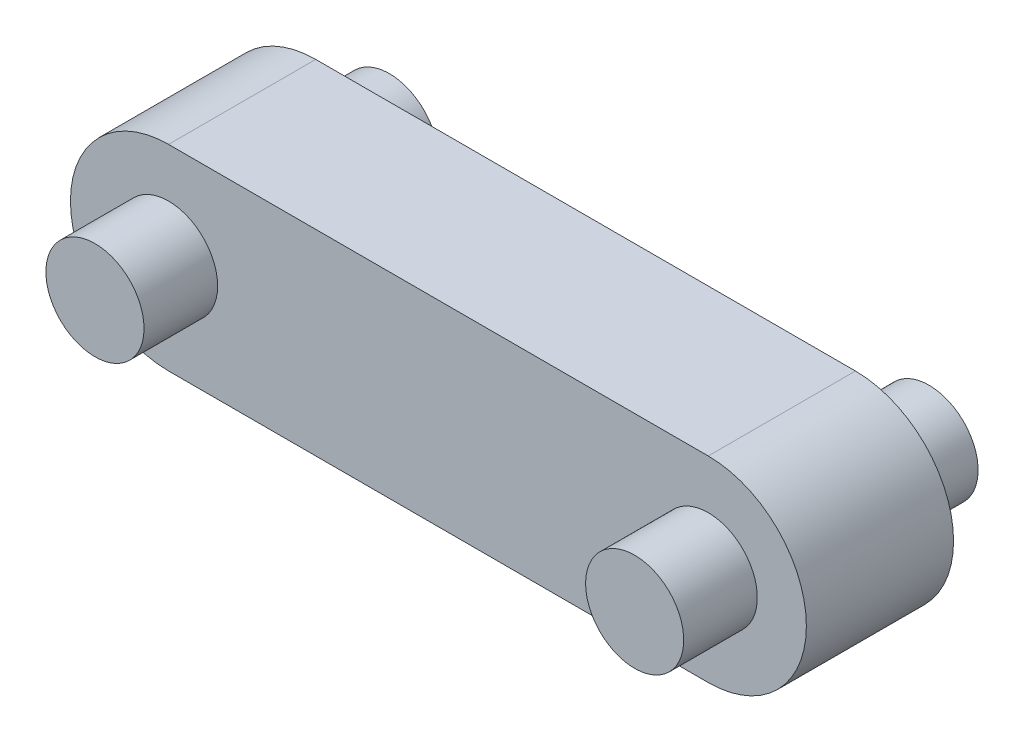
ISO-10303-21;
HEADER;
FILE_DESCRIPTION(('STEP AP214'),'2;1');
FILE_NAME('part.step','',(''),(''),'','','');
FILE_SCHEMA(('AUTOMOTIVE_DESIGN { 1 0 10303 214 1 1 1 1 }'));
ENDSEC;
DATA;
#1=APPLICATION_CONTEXT('core data for automotive mechanical design processes');
#2=APPLICATION_PROTOCOL_DEFINITION('international standard','automotive_design',2000,#1);
#3=PRODUCT_CONTEXT('',#1,'mechanical');
#4=PRODUCT('Part','Part','',(#3));
#5=PRODUCT_RELATED_PRODUCT_CATEGORY('part','',(#4));
#6=PRODUCT_DEFINITION_FORMATION('','',#4);
#7=PRODUCT_DEFINITION_CONTEXT('part definition',#1,'design');
#8=PRODUCT_DEFINITION('design','',#6,#7);
#9=PRODUCT_DEFINITION_SHAPE('','',#8);
#10=(LENGTH_UNIT() NAMED_UNIT(*) SI_UNIT(.MILLI.,.METRE.));
#11=(NAMED_UNIT(*) PLANE_ANGLE_UNIT() SI_UNIT($,.RADIAN.));
#12=(NAMED_UNIT(*) SI_UNIT($,.STERADIAN.) SOLID_ANGLE_UNIT());
#13=UNCERTAINTY_MEASURE_WITH_UNIT(LENGTH_MEASURE(1.E-05),#10,'distance_accuracy_value','');
#14=(GEOMETRIC_REPRESENTATION_CONTEXT(3) GLOBAL_UNCERTAINTY_ASSIGNED_CONTEXT((#13)) GLOBAL_UNIT_ASSIGNED_CONTEXT((#10,
#11,#12)) REPRESENTATION_CONTEXT('',''));
#15=CARTESIAN_POINT('',(0.,0.,0.));
#16=DIRECTION('',(0.,0.,1.));
#17=DIRECTION('',(1.,0.,0.));
#18=AXIS2_PLACEMENT_3D('',#15,#16,#17);
#19=CARTESIAN_POINT('',(0.,0.,30.));
#20=DIRECTION('',(0.,0.,-1.));
#21=DIRECTION('',(-1.,0.,0.));
#22=AXIS2_PLACEMENT_3D('',#19,#20,#21);
#23=CYLINDRICAL_SURFACE('',#22,10.);
#24=CARTESIAN_POINT('',(0.,0.,15.));
#25=DIRECTION('',(0.,0.,1.));
#26=DIRECTION('',(1.,0.,0.));
#27=AXIS2_PLACEMENT_3D('',#24,#25,#26);
#28=CIRCLE('',#27,10.);
#29=CARTESIAN_POINT('',(10.,0.,15.));
#30=VERTEX_POINT('',#29);
#31=EDGE_CURVE('E35',#30,#30,#28,.T.);
#32=ORIENTED_EDGE('',*,*,#31,.T.);
#33=EDGE_LOOP('',(#32));
#34=FACE_BOUND('',#33,.T.);
#35=CARTESIAN_POINT('',(0.,0.,30.));
#36=DIRECTION('',(0.,0.,1.));
#37=DIRECTION('',(1.,0.,0.));
#38=AXIS2_PLACEMENT_3D('',#35,#36,#37);
#39=CIRCLE('',#38,10.);
#40=CARTESIAN_POINT('',(10.,0.,30.));
#41=VERTEX_POINT('',#40);
#42=EDGE_CURVE('E41',#41,#41,#39,.T.);
#43=ORIENTED_EDGE('',*,*,#42,.F.);
#44=EDGE_LOOP('',(#43));
#45=FACE_BOUND('',#44,.T.);
#46=ADVANCED_FACE('F32',(#34,#45),#23,.T.);
#47=CARTESIAN_POINT('',(0.,0.,30.));
#48=DIRECTION('',(0.,0.,1.));
#49=DIRECTION('',(1.,0.,0.));
#50=AXIS2_PLACEMENT_3D('',#47,#48,#49);
#51=PLANE('',#50);
#52=ORIENTED_EDGE('',*,*,#42,.T.);
#53=EDGE_LOOP('',(#52));
#54=FACE_BOUND('',#53,.T.);
#55=ADVANCED_FACE('F135',(#54),#51,.T.);
#56=CARTESIAN_POINT('',(0.,0.,15.));
#57=DIRECTION('',(0.,0.,1.));
#58=DIRECTION('',(1.,0.,0.));
#59=AXIS2_PLACEMENT_3D('',#56,#57,#58);
#60=PLANE('',#59);
#61=CARTESIAN_POINT('',(0.,0.,15.));
#62=DIRECTION('',(0.,0.,1.));
#63=DIRECTION('',(1.,0.,0.));
#64=AXIS2_PLACEMENT_3D('',#61,#62,#63);
#65=CIRCLE('',#64,20.);
#66=CARTESIAN_POINT('',(0.,20.,15.));
#67=VERTEX_POINT('',#66);
#68=CARTESIAN_POINT('',(0.,-20.,15.));
#69=VERTEX_POINT('',#68);
#70=EDGE_CURVE('E83',#67,#69,#65,.T.);
#71=ORIENTED_EDGE('',*,*,#70,.T.);
#72=DIRECTION('',(1.,0.,0.));
#73=VECTOR('',#72,1.);
#74=CARTESIAN_POINT('',(55.,-20.,15.));
#75=LINE('',#74,#73);
#76=CARTESIAN_POINT('',(110.,-20.,15.));
#77=VERTEX_POINT('',#76);
#78=EDGE_CURVE('E112',#69,#77,#75,.T.);
#79=ORIENTED_EDGE('',*,*,#78,.T.);
#80=CARTESIAN_POINT('',(110.,0.,15.));
#81=DIRECTION('',(0.,0.,-1.));
#82=DIRECTION('',(-1.,0.,0.));
#83=AXIS2_PLACEMENT_3D('',#80,#81,#82);
#84=CIRCLE('',#83,20.);
#85=CARTESIAN_POINT('',(110.,20.,15.));
#86=VERTEX_POINT('',#85);
#87=EDGE_CURVE('E90',#86,#77,#84,.T.);
#88=ORIENTED_EDGE('',*,*,#87,.F.);
#89=DIRECTION('',(-1.,0.,0.));
#90=VECTOR('',#89,1.);
#91=CARTESIAN_POINT('',(0.,20.,15.));
#92=LINE('',#91,#90);
#93=EDGE_CURVE('E49',#86,#67,#92,.T.);
#94=ORIENTED_EDGE('',*,*,#93,.T.);
#95=EDGE_LOOP('',(#71,#79,#88,#94));
#96=FACE_BOUND('',#95,.T.);
#97=ORIENTED_EDGE('',*,*,#31,.F.);
#98=EDGE_LOOP('',(#97));
#99=FACE_BOUND('',#98,.T.);
#100=CARTESIAN_POINT('',(110.,0.,15.));
#101=DIRECTION('',(0.,0.,-1.));
#102=DIRECTION('',(-1.,0.,0.));
#103=AXIS2_PLACEMENT_3D('',#100,#101,#102);
#104=CIRCLE('',#103,10.);
#105=CARTESIAN_POINT('',(100.,0.,15.));
#106=VERTEX_POINT('',#105);
#107=EDGE_CURVE('E99',#106,#106,#104,.T.);
#108=ORIENTED_EDGE('',*,*,#107,.T.);
#109=EDGE_LOOP('',(#108));
#110=FACE_BOUND('',#109,.T.);
#111=ADVANCED_FACE('F132',(#96,#99,#110),#60,.T.);
#112=CARTESIAN_POINT('',(0.,0.,-15.));
#113=DIRECTION('',(0.,0.,1.));
#114=DIRECTION('',(1.,0.,0.));
#115=AXIS2_PLACEMENT_3D('',#112,#113,#114);
#116=PLANE('',#115);
#117=CARTESIAN_POINT('',(0.,0.,-15.));
#118=DIRECTION('',(0.,0.,1.));
#119=DIRECTION('',(1.,0.,0.));
#120=AXIS2_PLACEMENT_3D('',#117,#118,#119);
#121=CIRCLE('',#120,20.);
#122=CARTESIAN_POINT('',(0.,20.,-15.));
#123=VERTEX_POINT('',#122);
#124=CARTESIAN_POINT('',(0.,-20.,-15.));
#125=VERTEX_POINT('',#124);
#126=EDGE_CURVE('E81',#123,#125,#121,.T.);
#127=ORIENTED_EDGE('',*,*,#126,.F.);
#128=DIRECTION('',(-1.,0.,0.));
#129=VECTOR('',#128,1.);
#130=CARTESIAN_POINT('',(0.,20.,-15.));
#131=LINE('',#130,#129);
#132=CARTESIAN_POINT('',(110.,20.,-15.));
#133=VERTEX_POINT('',#132);
#134=EDGE_CURVE('E75',#133,#123,#131,.T.);
#135=ORIENTED_EDGE('',*,*,#134,.F.);
#136=CARTESIAN_POINT('',(110.,0.,-15.));
#137=DIRECTION('',(0.,0.,-1.));
#138=DIRECTION('',(-1.,0.,0.));
#139=AXIS2_PLACEMENT_3D('',#136,#137,#138);
#140=CIRCLE('',#139,20.);
#141=CARTESIAN_POINT('',(110.,-20.,-15.));
#142=VERTEX_POINT('',#141);
#143=EDGE_CURVE('E79',#133,#142,#140,.T.);
#144=ORIENTED_EDGE('',*,*,#143,.T.);
#145=DIRECTION('',(1.,0.,0.));
#146=VECTOR('',#145,1.);
#147=CARTESIAN_POINT('',(55.,-20.,-15.));
#148=LINE('',#147,#146);
#149=EDGE_CURVE('E61',#125,#142,#148,.T.);
#150=ORIENTED_EDGE('',*,*,#149,.F.);
#151=EDGE_LOOP('',(#127,#135,#144,#150));
#152=FACE_BOUND('',#151,.T.);
#153=CARTESIAN_POINT('',(0.,0.,-15.));
#154=DIRECTION('',(0.,0.,1.));
#155=DIRECTION('',(1.,0.,0.));
#156=AXIS2_PLACEMENT_3D('',#153,#154,#155);
#157=CIRCLE('',#156,10.);
#158=CARTESIAN_POINT('',(10.,0.,-15.));
#159=VERTEX_POINT('',#158);
#160=EDGE_CURVE('E11',#159,#159,#157,.T.);
#161=ORIENTED_EDGE('',*,*,#160,.T.);
#162=EDGE_LOOP('',(#161));
#163=FACE_BOUND('',#162,.T.);
#164=CARTESIAN_POINT('',(110.,0.,-15.));
#165=DIRECTION('',(0.,0.,-1.));
#166=DIRECTION('',(-1.,0.,0.));
#167=AXIS2_PLACEMENT_3D('',#164,#165,#166);
#168=CIRCLE('',#167,10.);
#169=CARTESIAN_POINT('',(100.,0.,-15.));
#170=VERTEX_POINT('',#169);
#171=EDGE_CURVE('E103',#170,#170,#168,.T.);
#172=ORIENTED_EDGE('',*,*,#171,.F.);
#173=EDGE_LOOP('',(#172));
#174=FACE_BOUND('',#173,.T.);
#175=ADVANCED_FACE('F76',(#152,#163,#174),#116,.F.);
#176=CARTESIAN_POINT('',(0.,0.,15.));
#177=DIRECTION('',(0.,0.,-1.));
#178=DIRECTION('',(-1.,0.,0.));
#179=AXIS2_PLACEMENT_3D('',#176,#177,#178);
#180=CYLINDRICAL_SURFACE('',#179,20.);
#181=ORIENTED_EDGE('',*,*,#126,.T.);
#182=DIRECTION('',(0.,0.,-1.));
#183=VECTOR('',#182,1.);
#184=CARTESIAN_POINT('',(0.,-20.,15.));
#185=LINE('',#184,#183);
#186=EDGE_CURVE('E119',#69,#125,#185,.T.);
#187=ORIENTED_EDGE('',*,*,#186,.F.);
#188=ORIENTED_EDGE('',*,*,#70,.F.);
#189=DIRECTION('',(0.,0.,-1.));
#190=VECTOR('',#189,1.);
#191=CARTESIAN_POINT('',(0.,20.,15.));
#192=LINE('',#191,#190);
#193=EDGE_CURVE('E115',#67,#123,#192,.T.);
#194=ORIENTED_EDGE('',*,*,#193,.T.);
#195=EDGE_LOOP('',(#181,#187,#188,#194));
#196=FACE_BOUND('',#195,.T.);
#197=ADVANCED_FACE('F172',(#196),#180,.T.);
#198=CARTESIAN_POINT('',(55.,-20.,15.));
#199=DIRECTION('',(0.,1.,0.));
#200=DIRECTION('',(0.,0.,1.));
#201=AXIS2_PLACEMENT_3D('',#198,#199,#200);
#202=PLANE('',#201);
#203=ORIENTED_EDGE('',*,*,#149,.T.);
#204=DIRECTION('',(0.,0.,-1.));
#205=VECTOR('',#204,1.);
#206=CARTESIAN_POINT('',(110.,-20.,15.));
#207=LINE('',#206,#205);
#208=EDGE_CURVE('E89',#77,#142,#207,.T.);
#209=ORIENTED_EDGE('',*,*,#208,.F.);
#210=ORIENTED_EDGE('',*,*,#78,.F.);
#211=ORIENTED_EDGE('',*,*,#186,.T.);
#212=EDGE_LOOP('',(#203,#209,#210,#211));
#213=FACE_BOUND('',#212,.T.);
#214=ADVANCED_FACE('F186',(#213),#202,.F.);
#215=CARTESIAN_POINT('',(0.,20.,15.));
#216=DIRECTION('',(0.,-1.,0.));
#217=DIRECTION('',(0.,0.,-1.));
#218=AXIS2_PLACEMENT_3D('',#215,#216,#217);
#219=PLANE('',#218);
#220=ORIENTED_EDGE('',*,*,#134,.T.);
#221=ORIENTED_EDGE('',*,*,#193,.F.);
#222=ORIENTED_EDGE('',*,*,#93,.F.);
#223=DIRECTION('',(0.,0.,-1.));
#224=VECTOR('',#223,1.);
#225=CARTESIAN_POINT('',(110.,20.,15.));
#226=LINE('',#225,#224);
#227=EDGE_CURVE('E85',#86,#133,#226,.T.);
#228=ORIENTED_EDGE('',*,*,#227,.T.);
#229=EDGE_LOOP('',(#220,#221,#222,#228));
#230=FACE_BOUND('',#229,.T.);
#231=ADVANCED_FACE('F86',(#230),#219,.F.);
#232=CARTESIAN_POINT('',(0.,0.,-30.));
#233=DIRECTION('',(0.,0.,1.));
#234=DIRECTION('',(1.,0.,0.));
#235=AXIS2_PLACEMENT_3D('',#232,#233,#234);
#236=PLANE('',#235);
#237=CARTESIAN_POINT('',(0.,0.,-30.));
#238=DIRECTION('',(0.,0.,1.));
#239=DIRECTION('',(1.,0.,0.));
#240=AXIS2_PLACEMENT_3D('',#237,#238,#239);
#241=CIRCLE('',#240,10.);
#242=CARTESIAN_POINT('',(10.,0.,-30.));
#243=VERTEX_POINT('',#242);
#244=EDGE_CURVE('E123',#243,#243,#241,.T.);
#245=ORIENTED_EDGE('',*,*,#244,.F.);
#246=EDGE_LOOP('',(#245));
#247=FACE_BOUND('',#246,.T.);
#248=ADVANCED_FACE('F163',(#247),#236,.F.);
#249=ORIENTED_EDGE('',*,*,#244,.T.);
#250=EDGE_LOOP('',(#249));
#251=FACE_BOUND('',#250,.T.);
#252=ORIENTED_EDGE('',*,*,#160,.F.);
#253=EDGE_LOOP('',(#252));
#254=FACE_BOUND('',#253,.T.);
#255=ADVANCED_FACE('F143',(#251,#254),#23,.T.);
#256=CARTESIAN_POINT('',(110.,0.,30.));
#257=DIRECTION('',(0.,0.,-1.));
#258=DIRECTION('',(1.,0.,0.));
#259=AXIS2_PLACEMENT_3D('',#256,#257,#258);
#260=CYLINDRICAL_SURFACE('',#259,10.);
#261=ORIENTED_EDGE('',*,*,#107,.F.);
#262=EDGE_LOOP('',(#261));
#263=FACE_BOUND('',#262,.T.);
#264=CARTESIAN_POINT('',(110.,0.,30.));
#265=DIRECTION('',(0.,0.,-1.));
#266=DIRECTION('',(-1.,0.,0.));
#267=AXIS2_PLACEMENT_3D('',#264,#265,#266);
#268=CIRCLE('',#267,10.);
#269=CARTESIAN_POINT('',(100.,0.,30.));
#270=VERTEX_POINT('',#269);
#271=EDGE_CURVE('E100',#270,#270,#268,.T.);
#272=ORIENTED_EDGE('',*,*,#271,.T.);
#273=EDGE_LOOP('',(#272));
#274=FACE_BOUND('',#273,.T.);
#275=ADVANCED_FACE('F139',(#263,#274),#260,.T.);
#276=CARTESIAN_POINT('',(110.,0.,30.));
#277=DIRECTION('',(0.,0.,1.));
#278=DIRECTION('',(-1.,0.,0.));
#279=AXIS2_PLACEMENT_3D('',#276,#277,#278);
#280=PLANE('',#279);
#281=ORIENTED_EDGE('',*,*,#271,.F.);
#282=EDGE_LOOP('',(#281));
#283=FACE_BOUND('',#282,.T.);
#284=ADVANCED_FACE('F142',(#283),#280,.T.);
#285=CARTESIAN_POINT('',(110.,0.,15.));
#286=DIRECTION('',(0.,0.,-1.));
#287=DIRECTION('',(1.,0.,0.));
#288=AXIS2_PLACEMENT_3D('',#285,#286,#287);
#289=CYLINDRICAL_SURFACE('',#288,20.);
#290=ORIENTED_EDGE('',*,*,#143,.F.);
#291=ORIENTED_EDGE('',*,*,#227,.F.);
#292=ORIENTED_EDGE('',*,*,#87,.T.);
#293=ORIENTED_EDGE('',*,*,#208,.T.);
#294=EDGE_LOOP('',(#290,#291,#292,#293));
#295=FACE_BOUND('',#294,.T.);
#296=ADVANCED_FACE('F93',(#295),#289,.T.);
#297=CARTESIAN_POINT('',(110.,0.,-30.));
#298=DIRECTION('',(0.,0.,1.));
#299=DIRECTION('',(-1.,0.,0.));
#300=AXIS2_PLACEMENT_3D('',#297,#298,#299);
#301=PLANE('',#300);
#302=CARTESIAN_POINT('',(110.,0.,-30.));
#303=DIRECTION('',(0.,0.,-1.));
#304=DIRECTION('',(-1.,0.,0.));
#305=AXIS2_PLACEMENT_3D('',#302,#303,#304);
#306=CIRCLE('',#305,10.);
#307=CARTESIAN_POINT('',(100.,0.,-30.));
#308=VERTEX_POINT('',#307);
#309=EDGE_CURVE('E104',#308,#308,#306,.T.);
#310=ORIENTED_EDGE('',*,*,#309,.T.);
#311=EDGE_LOOP('',(#310));
#312=FACE_BOUND('',#311,.T.);
#313=ADVANCED_FACE('F153',(#312),#301,.F.);
#314=ORIENTED_EDGE('',*,*,#309,.F.);
#315=EDGE_LOOP('',(#314));
#316=FACE_BOUND('',#315,.T.);
#317=ORIENTED_EDGE('',*,*,#171,.T.);
#318=EDGE_LOOP('',(#317));
#319=FACE_BOUND('',#318,.T.);
#320=ADVANCED_FACE('F145',(#316,#319),#260,.T.);
#321=CLOSED_SHELL('',(#46,#55,#111,#175,#197,#214,#231,#248,#255,#275,#284,#296,#313,#320));
#322=MANIFOLD_SOLID_BREP('B2',#321);
#323=ADVANCED_BREP_SHAPE_REPRESENTATION('',(#18,#322),#14);
#324=SHAPE_DEFINITION_REPRESENTATION(#9,#323);
ENDSEC;
END-ISO-10303-21;
